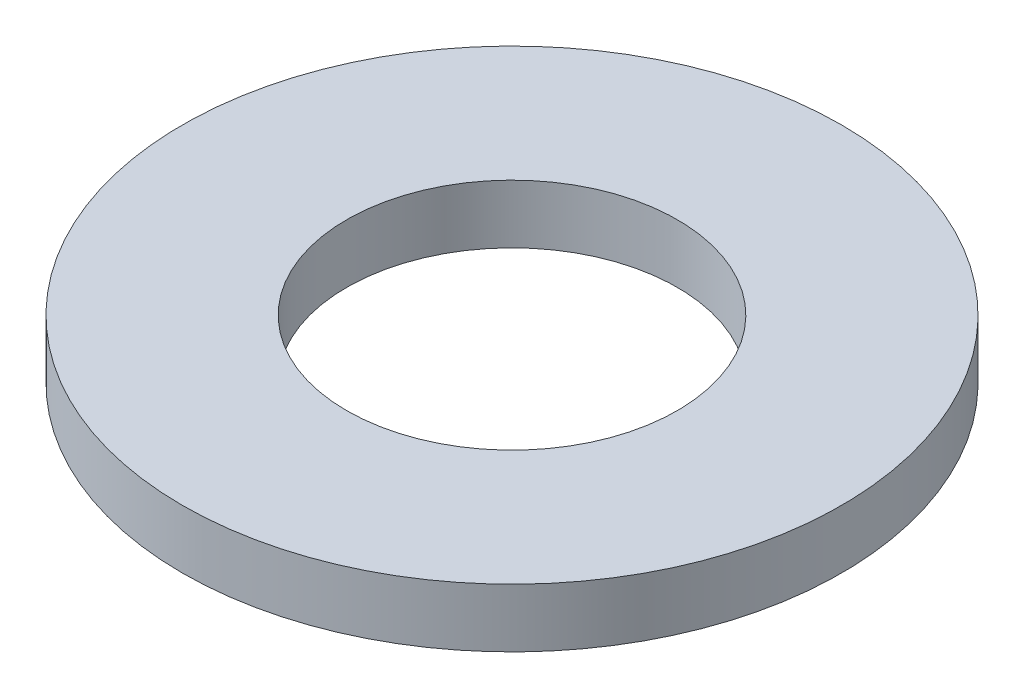
ISO-10303-21;
HEADER;
FILE_DESCRIPTION(('STEP AP214'),'2;1');
FILE_NAME('part.step','',(''),(''),'','','');
FILE_SCHEMA(('AUTOMOTIVE_DESIGN { 1 0 10303 214 1 1 1 1 }'));
ENDSEC;
DATA;
#1=APPLICATION_CONTEXT('core data for automotive mechanical design processes');
#2=APPLICATION_PROTOCOL_DEFINITION('international standard','automotive_design',2000,#1);
#3=PRODUCT_CONTEXT('',#1,'mechanical');
#4=PRODUCT('Part','Part','',(#3));
#5=PRODUCT_RELATED_PRODUCT_CATEGORY('part','',(#4));
#6=PRODUCT_DEFINITION_FORMATION('','',#4);
#7=PRODUCT_DEFINITION_CONTEXT('part definition',#1,'design');
#8=PRODUCT_DEFINITION('design','',#6,#7);
#9=PRODUCT_DEFINITION_SHAPE('','',#8);
#10=(LENGTH_UNIT() NAMED_UNIT(*) SI_UNIT(.MILLI.,.METRE.));
#11=(NAMED_UNIT(*) PLANE_ANGLE_UNIT() SI_UNIT($,.RADIAN.));
#12=(NAMED_UNIT(*) SI_UNIT($,.STERADIAN.) SOLID_ANGLE_UNIT());
#13=UNCERTAINTY_MEASURE_WITH_UNIT(LENGTH_MEASURE(1.E-05),#10,'distance_accuracy_value','');
#14=(GEOMETRIC_REPRESENTATION_CONTEXT(3) GLOBAL_UNCERTAINTY_ASSIGNED_CONTEXT((#13)) GLOBAL_UNIT_ASSIGNED_CONTEXT((#10,
#11,#12)) REPRESENTATION_CONTEXT('',''));
#15=CARTESIAN_POINT('',(0.,0.,0.));
#16=DIRECTION('',(0.,0.,1.));
#17=DIRECTION('',(1.,0.,0.));
#18=AXIS2_PLACEMENT_3D('',#15,#16,#17);
#19=CARTESIAN_POINT('',(0.,0.635,0.));
#20=DIRECTION('',(0.,-1.,0.));
#21=DIRECTION('',(0.,0.,-1.));
#22=AXIS2_PLACEMENT_3D('',#19,#20,#21);
#23=CYLINDRICAL_SURFACE('',#22,3.5687);
#24=CARTESIAN_POINT('',(0.,0.635,0.));
#25=DIRECTION('',(0.,1.,0.));
#26=DIRECTION('',(0.,0.,1.));
#27=AXIS2_PLACEMENT_3D('',#24,#25,#26);
#28=CIRCLE('',#27,3.5687);
#29=CARTESIAN_POINT('',(0.,0.635,3.5687));
#30=VERTEX_POINT('',#29);
#31=EDGE_CURVE('E10',#30,#30,#28,.T.);
#32=ORIENTED_EDGE('',*,*,#31,.F.);
#33=EDGE_LOOP('',(#32));
#34=FACE_BOUND('',#33,.T.);
#35=CARTESIAN_POINT('',(0.,0.,0.));
#36=DIRECTION('',(0.,1.,0.));
#37=DIRECTION('',(0.,0.,1.));
#38=AXIS2_PLACEMENT_3D('',#35,#36,#37);
#39=CIRCLE('',#38,3.5687);
#40=CARTESIAN_POINT('',(0.,0.,3.5687));
#41=VERTEX_POINT('',#40);
#42=EDGE_CURVE('E33',#41,#41,#39,.T.);
#43=ORIENTED_EDGE('',*,*,#42,.T.);
#44=EDGE_LOOP('',(#43));
#45=FACE_BOUND('',#44,.T.);
#46=ADVANCED_FACE('F30',(#34,#45),#23,.T.);
#47=CARTESIAN_POINT('',(0.,0.635,0.));
#48=DIRECTION('',(0.,1.,0.));
#49=DIRECTION('',(0.,0.,1.));
#50=AXIS2_PLACEMENT_3D('',#47,#48,#49);
#51=PLANE('',#50);
#52=CARTESIAN_POINT('',(0.,0.635,0.));
#53=DIRECTION('',(0.,1.,0.));
#54=DIRECTION('',(0.,0.,1.));
#55=AXIS2_PLACEMENT_3D('',#52,#53,#54);
#56=CIRCLE('',#55,1.7907);
#57=CARTESIAN_POINT('',(0.,0.635,1.7907));
#58=VERTEX_POINT('',#57);
#59=EDGE_CURVE('E42',#58,#58,#56,.T.);
#60=ORIENTED_EDGE('',*,*,#59,.F.);
#61=EDGE_LOOP('',(#60));
#62=FACE_BOUND('',#61,.T.);
#63=ORIENTED_EDGE('',*,*,#31,.T.);
#64=EDGE_LOOP('',(#63));
#65=FACE_BOUND('',#64,.T.);
#66=ADVANCED_FACE('F57',(#62,#65),#51,.T.);
#67=CARTESIAN_POINT('',(0.,0.,0.));
#68=DIRECTION('',(0.,1.,0.));
#69=DIRECTION('',(0.,0.,1.));
#70=AXIS2_PLACEMENT_3D('',#67,#68,#69);
#71=PLANE('',#70);
#72=CARTESIAN_POINT('',(0.,0.,0.));
#73=DIRECTION('',(0.,1.,0.));
#74=DIRECTION('',(0.,0.,1.));
#75=AXIS2_PLACEMENT_3D('',#72,#73,#74);
#76=CIRCLE('',#75,1.7907);
#77=CARTESIAN_POINT('',(0.,0.,1.7907));
#78=VERTEX_POINT('',#77);
#79=EDGE_CURVE('E40',#78,#78,#76,.T.);
#80=ORIENTED_EDGE('',*,*,#79,.T.);
#81=EDGE_LOOP('',(#80));
#82=FACE_BOUND('',#81,.T.);
#83=ORIENTED_EDGE('',*,*,#42,.F.);
#84=EDGE_LOOP('',(#83));
#85=FACE_BOUND('',#84,.T.);
#86=ADVANCED_FACE('F48',(#82,#85),#71,.F.);
#87=CARTESIAN_POINT('',(0.,0.,0.));
#88=DIRECTION('',(0.,1.,0.));
#89=DIRECTION('',(0.,0.,1.));
#90=AXIS2_PLACEMENT_3D('',#87,#88,#89);
#91=CYLINDRICAL_SURFACE('',#90,1.7907);
#92=ORIENTED_EDGE('',*,*,#79,.F.);
#93=EDGE_LOOP('',(#92));
#94=FACE_BOUND('',#93,.T.);
#95=ORIENTED_EDGE('',*,*,#59,.T.);
#96=EDGE_LOOP('',(#95));
#97=FACE_BOUND('',#96,.T.);
#98=ADVANCED_FACE('F51',(#94,#97),#91,.F.);
#99=CLOSED_SHELL('',(#46,#66,#86,#98));
#100=MANIFOLD_SOLID_BREP('B2',#99);
#101=ADVANCED_BREP_SHAPE_REPRESENTATION('',(#18,#100),#14);
#102=SHAPE_DEFINITION_REPRESENTATION(#9,#101);
ENDSEC;
END-ISO-10303-21;
